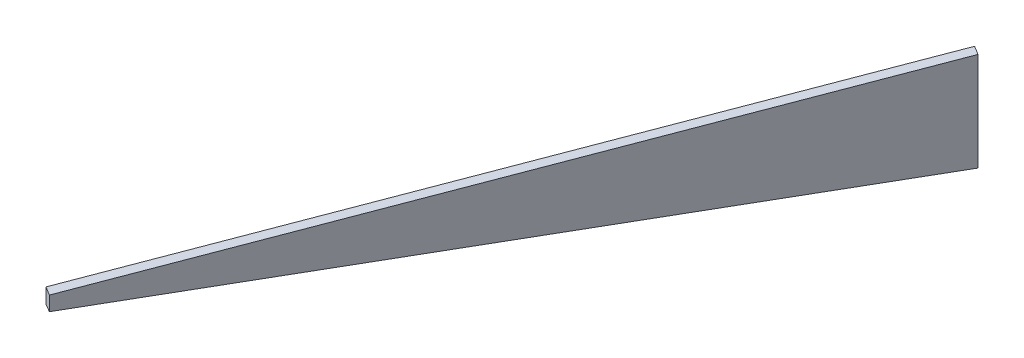
ISO-10303-21;
HEADER;
FILE_DESCRIPTION(('STEP AP214'),'2;1');
FILE_NAME('part.step','',(''),(''),'','','');
FILE_SCHEMA(('AUTOMOTIVE_DESIGN { 1 0 10303 214 1 1 1 1 }'));
ENDSEC;
DATA;
#1=APPLICATION_CONTEXT('core data for automotive mechanical design processes');
#2=APPLICATION_PROTOCOL_DEFINITION('international standard','automotive_design',2000,#1);
#3=PRODUCT_CONTEXT('',#1,'mechanical');
#4=PRODUCT('Part','Part','',(#3));
#5=PRODUCT_RELATED_PRODUCT_CATEGORY('part','',(#4));
#6=PRODUCT_DEFINITION_FORMATION('','',#4);
#7=PRODUCT_DEFINITION_CONTEXT('part definition',#1,'design');
#8=PRODUCT_DEFINITION('design','',#6,#7);
#9=PRODUCT_DEFINITION_SHAPE('','',#8);
#10=(LENGTH_UNIT() NAMED_UNIT(*) SI_UNIT(.MILLI.,.METRE.));
#11=(NAMED_UNIT(*) PLANE_ANGLE_UNIT() SI_UNIT($,.RADIAN.));
#12=(NAMED_UNIT(*) SI_UNIT($,.STERADIAN.) SOLID_ANGLE_UNIT());
#13=UNCERTAINTY_MEASURE_WITH_UNIT(LENGTH_MEASURE(1.E-05),#10,'distance_accuracy_value','');
#14=(GEOMETRIC_REPRESENTATION_CONTEXT(3) GLOBAL_UNCERTAINTY_ASSIGNED_CONTEXT((#13)) GLOBAL_UNIT_ASSIGNED_CONTEXT((#10,
#11,#12)) REPRESENTATION_CONTEXT('',''));
#15=CARTESIAN_POINT('',(0.,0.,0.));
#16=DIRECTION('',(0.,0.,1.));
#17=DIRECTION('',(1.,0.,0.));
#18=AXIS2_PLACEMENT_3D('',#15,#16,#17);
#19=CARTESIAN_POINT('',(-462.076477371994,0.,825.739935790638));
#20=DIRECTION('',(0.866025403784429,0.,0.500000000000017));
#21=DIRECTION('',(0.500000000000017,0.,-0.866025403784429));
#22=AXIS2_PLACEMENT_3D('',#19,#20,#21);
#23=PLANE('',#22);
#24=DIRECTION('',(0.,1.,0.));
#25=VECTOR('',#24,1.);
#26=CARTESIAN_POINT('',(0.,0.,25.4));
#27=LINE('',#26,#25);
#28=CARTESIAN_POINT('',(-1.5216070586952E-11,133.815553949192,25.3999999999927));
#29=VERTEX_POINT('',#28);
#30=CARTESIAN_POINT('',(-1.52190507027266E-11,0.,25.399999999991));
#31=VERTEX_POINT('',#30);
#32=EDGE_CURVE('E20',#29,#31,#27,.F.);
#33=ORIENTED_EDGE('',*,*,#32,.F.);
#34=DIRECTION('',(0.496226558531676,0.122624673012581,-0.859489611441794));
#35=VECTOR('',#34,1.);
#36=CARTESIAN_POINT('',(-462.076477371994,19.6298539491972,825.73993579064));
#37=LINE('',#36,#35);
#38=CARTESIAN_POINT('',(-462.076477371991,19.6298539491879,825.739935790632));
#39=VERTEX_POINT('',#38);
#40=EDGE_CURVE('E79',#39,#29,#37,.T.);
#41=ORIENTED_EDGE('',*,*,#40,.F.);
#42=DIRECTION('',(0.,1.,0.));
#43=VECTOR('',#42,1.);
#44=CARTESIAN_POINT('',(-462.07647737198,0.,825.739935790614));
#45=LINE('',#44,#43);
#46=CARTESIAN_POINT('',(-462.076477371991,0.,825.739935790632));
#47=VERTEX_POINT('',#46);
#48=EDGE_CURVE('E61',#47,#39,#45,.T.);
#49=ORIENTED_EDGE('',*,*,#48,.F.);
#50=DIRECTION('',(0.50000000000005,0.,-0.86602540378441));
#51=VECTOR('',#50,1.);
#52=CARTESIAN_POINT('',(-462.076477371994,0.,825.739935790638));
#53=LINE('',#52,#51);
#54=EDGE_CURVE('E56',#47,#31,#53,.T.);
#55=ORIENTED_EDGE('',*,*,#54,.T.);
#56=EDGE_LOOP('',(#33,#41,#49,#55));
#57=FACE_BOUND('',#56,.T.);
#58=ADVANCED_FACE('F17',(#57),#23,.T.);
#59=CARTESIAN_POINT('',(0.,0.,25.4));
#60=DIRECTION('',(0.500000000000017,0.,-0.866025403784429));
#61=DIRECTION('',(-0.866025403784429,0.,-0.500000000000017));
#62=AXIS2_PLACEMENT_3D('',#59,#60,#61);
#63=PLANE('',#62);
#64=DIRECTION('',(0.,1.,0.));
#65=VECTOR('',#64,1.);
#66=CARTESIAN_POINT('',(-10.9985226280619,0.,19.05));
#67=LINE('',#66,#65);
#68=CARTESIAN_POINT('',(-10.9985226280619,134.721600000011,19.0500000000015));
#69=VERTEX_POINT('',#68);
#70=CARTESIAN_POINT('',(-10.9985226280619,0.,19.05));
#71=VERTEX_POINT('',#70);
#72=EDGE_CURVE('E83',#69,#71,#67,.F.);
#73=ORIENTED_EDGE('',*,*,#72,.F.);
#74=DIRECTION('',(-0.863829871803825,0.0711613432450286,-0.498732409020058));
#75=VECTOR('',#74,1.);
#76=CARTESIAN_POINT('',(0.,133.815553949228,25.4000000000069));
#77=LINE('',#76,#75);
#78=EDGE_CURVE('E68',#29,#69,#77,.T.);
#79=ORIENTED_EDGE('',*,*,#78,.F.);
#80=ORIENTED_EDGE('',*,*,#32,.T.);
#81=DIRECTION('',(-0.866025403784429,0.,-0.500000000000017));
#82=VECTOR('',#81,1.);
#83=CARTESIAN_POINT('',(0.,0.,25.4));
#84=LINE('',#83,#82);
#85=EDGE_CURVE('E63',#31,#71,#84,.T.);
#86=ORIENTED_EDGE('',*,*,#85,.T.);
#87=EDGE_LOOP('',(#73,#79,#80,#86));
#88=FACE_BOUND('',#87,.T.);
#89=ADVANCED_FACE('F65',(#88),#63,.T.);
#90=CARTESIAN_POINT('',(0.,0.,0.));
#91=DIRECTION('',(0.,1.,0.));
#92=DIRECTION('',(0.,0.,1.));
#93=AXIS2_PLACEMENT_3D('',#90,#91,#92);
#94=PLANE('',#93);
#95=DIRECTION('',(-0.500000000000017,0.,0.866025403784429));
#96=VECTOR('',#95,1.);
#97=CARTESIAN_POINT('',(-10.9985226280619,0.,19.05));
#98=LINE('',#97,#96);
#99=CARTESIAN_POINT('',(-473.075000000003,0.,819.389935790636));
#100=VERTEX_POINT('',#99);
#101=EDGE_CURVE('E72',#71,#100,#98,.T.);
#102=ORIENTED_EDGE('',*,*,#101,.F.);
#103=ORIENTED_EDGE('',*,*,#85,.F.);
#104=ORIENTED_EDGE('',*,*,#54,.F.);
#105=DIRECTION('',(0.866025403784429,0.,0.500000000000017));
#106=VECTOR('',#105,1.);
#107=CARTESIAN_POINT('',(-473.075,0.,819.389935790638));
#108=LINE('',#107,#106);
#109=EDGE_CURVE('E74',#100,#47,#108,.T.);
#110=ORIENTED_EDGE('',*,*,#109,.F.);
#111=EDGE_LOOP('',(#102,#103,#104,#110));
#112=FACE_BOUND('',#111,.T.);
#113=ADVANCED_FACE('F70',(#112),#94,.F.);
#114=CARTESIAN_POINT('',(-473.075,0.,819.389935790638));
#115=DIRECTION('',(-0.500000000000017,0.,0.866025403784429));
#116=DIRECTION('',(0.866025403784429,0.,0.500000000000017));
#117=AXIS2_PLACEMENT_3D('',#114,#115,#116);
#118=PLANE('',#117);
#119=ORIENTED_EDGE('',*,*,#48,.T.);
#120=DIRECTION('',(0.863829871802729,-0.0711613432452927,0.498732409021919));
#121=VECTOR('',#120,1.);
#122=CARTESIAN_POINT('',(-473.075,20.5359000000119,819.38993579064));
#123=LINE('',#122,#121);
#124=CARTESIAN_POINT('',(-473.075000000003,20.535900000003,819.389935790637));
#125=VERTEX_POINT('',#124);
#126=EDGE_CURVE('E35',#125,#39,#123,.T.);
#127=ORIENTED_EDGE('',*,*,#126,.F.);
#128=DIRECTION('',(0.,1.,0.));
#129=VECTOR('',#128,1.);
#130=CARTESIAN_POINT('',(-473.075000000011,0.,819.389935790632));
#131=LINE('',#130,#129);
#132=EDGE_CURVE('E26',#100,#125,#131,.T.);
#133=ORIENTED_EDGE('',*,*,#132,.F.);
#134=ORIENTED_EDGE('',*,*,#109,.T.);
#135=EDGE_LOOP('',(#119,#127,#133,#134));
#136=FACE_BOUND('',#135,.T.);
#137=ADVANCED_FACE('F89',(#136),#118,.T.);
#138=CARTESIAN_POINT('',(-236.5375,77.1757269746026,422.394967895446));
#139=DIRECTION('',(5.53688929302854E-06,0.989974759582632,0.141244381688805));
#140=DIRECTION('',(0.,-0.14124438169097,0.989974759597807));
#141=AXIS2_PLACEMENT_3D('',#138,#139,#140);
#142=PLANE('',#141);
#143=DIRECTION('',(0.496226558531643,0.122624673012551,-0.859489611441818));
#144=VECTOR('',#143,1.);
#145=CARTESIAN_POINT('',(-473.075000000011,20.5359,819.389935790632));
#146=LINE('',#145,#144);
#147=EDGE_CURVE('E11',#125,#69,#146,.T.);
#148=ORIENTED_EDGE('',*,*,#147,.F.);
#149=ORIENTED_EDGE('',*,*,#126,.T.);
#150=ORIENTED_EDGE('',*,*,#40,.T.);
#151=ORIENTED_EDGE('',*,*,#78,.T.);
#152=EDGE_LOOP('',(#148,#149,#150,#151));
#153=FACE_BOUND('',#152,.T.);
#154=ADVANCED_FACE('F91',(#153),#142,.T.);
#155=CARTESIAN_POINT('',(-10.9985226280619,0.,19.05));
#156=DIRECTION('',(-0.866025403784429,0.,-0.500000000000017));
#157=DIRECTION('',(-0.500000000000017,0.,0.866025403784429));
#158=AXIS2_PLACEMENT_3D('',#155,#156,#157);
#159=PLANE('',#158);
#160=ORIENTED_EDGE('',*,*,#132,.T.);
#161=ORIENTED_EDGE('',*,*,#147,.T.);
#162=ORIENTED_EDGE('',*,*,#72,.T.);
#163=ORIENTED_EDGE('',*,*,#101,.T.);
#164=EDGE_LOOP('',(#160,#161,#162,#163));
#165=FACE_BOUND('',#164,.T.);
#166=ADVANCED_FACE('F88',(#165),#159,.T.);
#167=CLOSED_SHELL('',(#58,#89,#113,#137,#154,#166));
#168=MANIFOLD_SOLID_BREP('B1',#167);
#169=ADVANCED_BREP_SHAPE_REPRESENTATION('',(#18,#168),#14);
#170=SHAPE_DEFINITION_REPRESENTATION(#9,#169);
ENDSEC;
END-ISO-10303-21;
